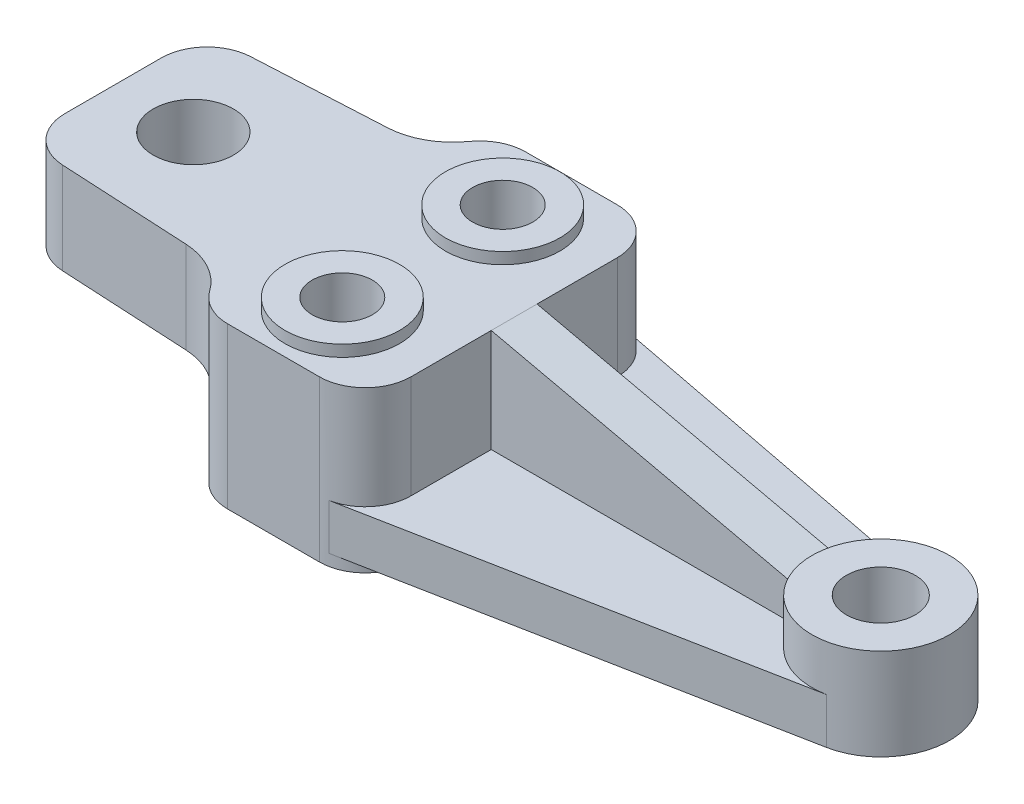
ISO-10303-21;
HEADER;
FILE_DESCRIPTION(('STEP AP214'),'2;1');
FILE_NAME('part.step','',(''),(''),'','','');
FILE_SCHEMA(('AUTOMOTIVE_DESIGN { 1 0 10303 214 1 1 1 1 }'));
ENDSEC;
DATA;
#1=APPLICATION_CONTEXT('core data for automotive mechanical design processes');
#2=APPLICATION_PROTOCOL_DEFINITION('international standard','automotive_design',2000,#1);
#3=PRODUCT_CONTEXT('',#1,'mechanical');
#4=PRODUCT('Part','Part','',(#3));
#5=PRODUCT_RELATED_PRODUCT_CATEGORY('part','',(#4));
#6=PRODUCT_DEFINITION_FORMATION('','',#4);
#7=PRODUCT_DEFINITION_CONTEXT('part definition',#1,'design');
#8=PRODUCT_DEFINITION('design','',#6,#7);
#9=PRODUCT_DEFINITION_SHAPE('','',#8);
#10=(LENGTH_UNIT() NAMED_UNIT(*) SI_UNIT(.MILLI.,.METRE.));
#11=(NAMED_UNIT(*) PLANE_ANGLE_UNIT() SI_UNIT($,.RADIAN.));
#12=(NAMED_UNIT(*) SI_UNIT($,.STERADIAN.) SOLID_ANGLE_UNIT());
#13=UNCERTAINTY_MEASURE_WITH_UNIT(LENGTH_MEASURE(1.E-05),#10,'distance_accuracy_value','');
#14=(GEOMETRIC_REPRESENTATION_CONTEXT(3) GLOBAL_UNCERTAINTY_ASSIGNED_CONTEXT((#13)) GLOBAL_UNIT_ASSIGNED_CONTEXT((#10,
#11,#12)) REPRESENTATION_CONTEXT('',''));
#15=CARTESIAN_POINT('',(0.,0.,0.));
#16=DIRECTION('',(0.,0.,1.));
#17=DIRECTION('',(1.,0.,0.));
#18=AXIS2_PLACEMENT_3D('',#15,#16,#17);
#19=CARTESIAN_POINT('',(0.,12.7,0.));
#20=DIRECTION('',(-1.,0.,0.));
#21=DIRECTION('',(0.,0.,1.));
#22=AXIS2_PLACEMENT_3D('',#19,#20,#21);
#23=PLANE('',#22);
#24=DIRECTION('',(0.,-1.,0.));
#25=VECTOR('',#24,1.);
#26=CARTESIAN_POINT('',(0.,12.7,28.5749999999999));
#27=LINE('',#26,#25);
#28=CARTESIAN_POINT('',(0.,15.875,28.5749999999999));
#29=VERTEX_POINT('',#28);
#30=CARTESIAN_POINT('',(0.,-3.175,28.5749999999999));
#31=VERTEX_POINT('',#30);
#32=EDGE_CURVE('E443',#29,#31,#27,.T.);
#33=ORIENTED_EDGE('',*,*,#32,.F.);
#34=DIRECTION('',(0.,0.,1.));
#35=VECTOR('',#34,1.);
#36=CARTESIAN_POINT('',(0.,15.875,0.));
#37=LINE('',#36,#35);
#38=CARTESIAN_POINT('',(0.,15.875,-28.5749999999999));
#39=VERTEX_POINT('',#38);
#40=EDGE_CURVE('E243',#39,#29,#37,.T.);
#41=ORIENTED_EDGE('',*,*,#40,.F.);
#42=DIRECTION('',(0.,-1.,0.));
#43=VECTOR('',#42,1.);
#44=CARTESIAN_POINT('',(0.,12.7,-28.5749999999999));
#45=LINE('',#44,#43);
#46=CARTESIAN_POINT('',(0.,-3.175,-28.5749999999999));
#47=VERTEX_POINT('',#46);
#48=EDGE_CURVE('E445',#39,#47,#45,.T.);
#49=ORIENTED_EDGE('',*,*,#48,.T.);
#50=DIRECTION('',(0.,0.,-1.));
#51=VECTOR('',#50,1.);
#52=CARTESIAN_POINT('',(0.,-3.175,0.));
#53=LINE('',#52,#51);
#54=EDGE_CURVE('E378',#31,#47,#53,.T.);
#55=ORIENTED_EDGE('',*,*,#54,.F.);
#56=EDGE_LOOP('',(#33,#41,#49,#55));
#57=FACE_BOUND('',#56,.T.);
#58=ADVANCED_FACE('F47',(#57),#23,.T.);
#59=CARTESIAN_POINT('',(0.,41.275,0.));
#60=DIRECTION('',(0.,1.,0.));
#61=DIRECTION('',(0.,0.,1.));
#62=AXIS2_PLACEMENT_3D('',#59,#60,#61);
#63=PLANE('',#62);
#64=CARTESIAN_POINT('',(12.7,41.275,-28.575));
#65=DIRECTION('',(0.,1.,0.));
#66=DIRECTION('',(0.,0.,1.));
#67=AXIS2_PLACEMENT_3D('',#64,#65,#66);
#68=CIRCLE('',#67,12.7);
#69=CARTESIAN_POINT('',(12.7000000000001,41.275,-41.275));
#70=VERTEX_POINT('',#69);
#71=CARTESIAN_POINT('',(2.34506952468571,41.275,-35.9279187980969));
#72=VERTEX_POINT('',#71);
#73=EDGE_CURVE('E355',#70,#72,#68,.T.);
#74=ORIENTED_EDGE('',*,*,#73,.T.);
#75=CARTESIAN_POINT('',(-13.1873261882857,41.275,-46.9572969952424));
#76=DIRECTION('',(0.,1.,0.));
#77=DIRECTION('',(0.,0.,1.));
#78=AXIS2_PLACEMENT_3D('',#75,#76,#77);
#79=CIRCLE('',#78,19.05);
#80=CARTESIAN_POINT('',(-12.1860804172971,41.275,-27.933627346458));
#81=VERTEX_POINT('',#80);
#82=EDGE_CURVE('E262',#81,#72,#79,.T.);
#83=ORIENTED_EDGE('',*,*,#82,.F.);
#84=DIRECTION('',(0.99861782933251,0.,-0.0525588331227634));
#85=VECTOR('',#84,1.);
#86=CARTESIAN_POINT('',(-1.49979281767955,41.275,-28.4960635359116));
#87=LINE('',#86,#85);
#88=CARTESIAN_POINT('',(-48.2924971806591,41.275,-26.0332896220706));
#89=VERTEX_POINT('',#88);
#90=EDGE_CURVE('E235',#89,#81,#87,.T.);
#91=ORIENTED_EDGE('',*,*,#90,.F.);
#92=CARTESIAN_POINT('',(-47.625,41.275,-13.3508431895477));
#93=DIRECTION('',(0.,1.,0.));
#94=DIRECTION('',(0.,0.,1.));
#95=AXIS2_PLACEMENT_3D('',#92,#93,#94);
#96=CIRCLE('',#95,12.7);
#97=CARTESIAN_POINT('',(-60.325,41.275,-13.3508431895477));
#98=VERTEX_POINT('',#97);
#99=EDGE_CURVE('E265',#89,#98,#96,.T.);
#100=ORIENTED_EDGE('',*,*,#99,.T.);
#101=DIRECTION('',(0.,0.,1.));
#102=VECTOR('',#101,1.);
#103=CARTESIAN_POINT('',(-60.325,41.275,0.));
#104=LINE('',#103,#102);
#105=CARTESIAN_POINT('',(-60.325,41.275,13.3508431895477));
#106=VERTEX_POINT('',#105);
#107=EDGE_CURVE('E268',#98,#106,#104,.T.);
#108=ORIENTED_EDGE('',*,*,#107,.T.);
#109=CARTESIAN_POINT('',(-47.625,41.275,13.3508431895477));
#110=DIRECTION('',(0.,1.,0.));
#111=DIRECTION('',(0.,0.,1.));
#112=AXIS2_PLACEMENT_3D('',#109,#110,#111);
#113=CIRCLE('',#112,12.7);
#114=CARTESIAN_POINT('',(-48.2924971806591,41.275,26.0332896220706));
#115=VERTEX_POINT('',#114);
#116=EDGE_CURVE('E271',#106,#115,#113,.T.);
#117=ORIENTED_EDGE('',*,*,#116,.T.);
#118=DIRECTION('',(0.99861782933251,0.,0.0525588331227633));
#119=VECTOR('',#118,1.);
#120=CARTESIAN_POINT('',(-1.49979281767955,41.275,28.4960635359116));
#121=LINE('',#120,#119);
#122=CARTESIAN_POINT('',(-12.1860804172971,41.275,27.9336273464581));
#123=VERTEX_POINT('',#122);
#124=EDGE_CURVE('E274',#115,#123,#121,.T.);
#125=ORIENTED_EDGE('',*,*,#124,.T.);
#126=CARTESIAN_POINT('',(-13.1873261882857,41.275,46.9572969952424));
#127=DIRECTION('',(0.,1.,0.));
#128=DIRECTION('',(0.,0.,1.));
#129=AXIS2_PLACEMENT_3D('',#126,#127,#128);
#130=CIRCLE('',#129,19.05);
#131=CARTESIAN_POINT('',(2.34506952468572,41.275,35.9279187980969));
#132=VERTEX_POINT('',#131);
#133=EDGE_CURVE('E277',#132,#123,#130,.T.);
#134=ORIENTED_EDGE('',*,*,#133,.F.);
#135=CARTESIAN_POINT('',(12.7,41.275,28.575));
#136=DIRECTION('',(0.,1.,0.));
#137=DIRECTION('',(0.,0.,1.));
#138=AXIS2_PLACEMENT_3D('',#135,#136,#137);
#139=CIRCLE('',#138,12.7);
#140=CARTESIAN_POINT('',(12.7000000000001,41.275,41.275));
#141=VERTEX_POINT('',#140);
#142=EDGE_CURVE('E357',#141,#132,#139,.F.);
#143=ORIENTED_EDGE('',*,*,#142,.F.);
#144=DIRECTION('',(-1.,0.,0.));
#145=VECTOR('',#144,1.);
#146=CARTESIAN_POINT('',(0.,41.275,41.275));
#147=LINE('',#146,#145);
#148=CARTESIAN_POINT('',(38.0999999999999,41.275,41.275));
#149=VERTEX_POINT('',#148);
#150=EDGE_CURVE('E359',#149,#141,#147,.T.);
#151=ORIENTED_EDGE('',*,*,#150,.F.);
#152=CARTESIAN_POINT('',(38.1,41.275,28.575));
#153=DIRECTION('',(0.,1.,0.));
#154=DIRECTION('',(0.,0.,1.));
#155=AXIS2_PLACEMENT_3D('',#152,#153,#154);
#156=CIRCLE('',#155,12.7);
#157=CARTESIAN_POINT('',(50.8,41.275,28.5749999999999));
#158=VERTEX_POINT('',#157);
#159=EDGE_CURVE('E362',#149,#158,#156,.T.);
#160=ORIENTED_EDGE('',*,*,#159,.T.);
#161=DIRECTION('',(0.,0.,1.));
#162=VECTOR('',#161,1.);
#163=CARTESIAN_POINT('',(50.8,41.275,0.));
#164=LINE('',#163,#162);
#165=CARTESIAN_POINT('',(50.8,41.275,6.35));
#166=VERTEX_POINT('',#165);
#167=EDGE_CURVE('E365',#166,#158,#164,.T.);
#168=ORIENTED_EDGE('',*,*,#167,.F.);
#169=DIRECTION('',(0.,0.,1.));
#170=VECTOR('',#169,1.);
#171=CARTESIAN_POINT('',(50.8,41.275,0.));
#172=LINE('',#171,#170);
#173=CARTESIAN_POINT('',(50.8,41.275,-6.35));
#174=VERTEX_POINT('',#173);
#175=EDGE_CURVE('E316',#174,#166,#172,.T.);
#176=ORIENTED_EDGE('',*,*,#175,.F.);
#177=CARTESIAN_POINT('',(50.8,41.275,-28.5749999999999));
#178=VERTEX_POINT('',#177);
#179=EDGE_CURVE('E366',#178,#174,#164,.T.);
#180=ORIENTED_EDGE('',*,*,#179,.F.);
#181=CARTESIAN_POINT('',(38.1,41.275,-28.575));
#182=DIRECTION('',(0.,1.,0.));
#183=DIRECTION('',(0.,0.,1.));
#184=AXIS2_PLACEMENT_3D('',#181,#182,#183);
#185=CIRCLE('',#184,12.7);
#186=CARTESIAN_POINT('',(38.0999999999999,41.275,-41.275));
#187=VERTEX_POINT('',#186);
#188=EDGE_CURVE('E349',#187,#178,#185,.F.);
#189=ORIENTED_EDGE('',*,*,#188,.F.);
#190=DIRECTION('',(-1.,0.,0.));
#191=VECTOR('',#190,1.);
#192=CARTESIAN_POINT('',(0.,41.275,-41.275));
#193=LINE('',#192,#191);
#194=EDGE_CURVE('E352',#187,#70,#193,.T.);
#195=ORIENTED_EDGE('',*,*,#194,.T.);
#196=EDGE_LOOP('',(#74,#83,#91,#100,#108,#117,#125,#134,#143,#151,#160,#168,#176,#180,#189,#195));
#197=FACE_BOUND('',#196,.T.);
#198=CARTESIAN_POINT('',(25.4,41.275,22.225));
#199=DIRECTION('',(0.,1.,0.));
#200=DIRECTION('',(0.,0.,1.));
#201=AXIS2_PLACEMENT_3D('',#198,#199,#200);
#202=CIRCLE('',#201,15.875);
#203=CARTESIAN_POINT('',(25.4,41.275,38.1));
#204=VERTEX_POINT('',#203);
#205=EDGE_CURVE('E306',#204,#204,#202,.T.);
#206=ORIENTED_EDGE('',*,*,#205,.F.);
#207=EDGE_LOOP('',(#206));
#208=FACE_BOUND('',#207,.T.);
#209=CARTESIAN_POINT('',(25.4,41.275,-22.225));
#210=DIRECTION('',(0.,1.,0.));
#211=DIRECTION('',(0.,0.,1.));
#212=AXIS2_PLACEMENT_3D('',#209,#210,#211);
#213=CIRCLE('',#212,15.875);
#214=CARTESIAN_POINT('',(25.4,41.275,-6.35));
#215=VERTEX_POINT('',#214);
#216=EDGE_CURVE('E297',#215,#215,#213,.T.);
#217=ORIENTED_EDGE('',*,*,#216,.F.);
#218=EDGE_LOOP('',(#217));
#219=FACE_BOUND('',#218,.T.);
#220=CARTESIAN_POINT('',(-38.1,41.275,0.));
#221=DIRECTION('',(0.,1.,0.));
#222=DIRECTION('',(0.,0.,1.));
#223=AXIS2_PLACEMENT_3D('',#220,#221,#222);
#224=CIRCLE('',#223,11.1125);
#225=CARTESIAN_POINT('',(-38.1,41.275,11.1125));
#226=VERTEX_POINT('',#225);
#227=EDGE_CURVE('E259',#226,#226,#224,.T.);
#228=ORIENTED_EDGE('',*,*,#227,.F.);
#229=EDGE_LOOP('',(#228));
#230=FACE_BOUND('',#229,.T.);
#231=ADVANCED_FACE('F483',(#197,#208,#219,#230),#63,.T.);
#232=CARTESIAN_POINT('',(0.,12.7,0.));
#233=DIRECTION('',(0.,1.,0.));
#234=DIRECTION('',(0.,0.,1.));
#235=AXIS2_PLACEMENT_3D('',#232,#233,#234);
#236=PLANE('',#235);
#237=DIRECTION('',(0.,0.,1.));
#238=VECTOR('',#237,1.);
#239=CARTESIAN_POINT('',(50.8,12.7,0.));
#240=LINE('',#239,#238);
#241=CARTESIAN_POINT('',(50.8,12.7,-28.5749999999999));
#242=VERTEX_POINT('',#241);
#243=CARTESIAN_POINT('',(50.8,12.7,-6.35));
#244=VERTEX_POINT('',#243);
#245=EDGE_CURVE('E410',#242,#244,#240,.T.);
#246=ORIENTED_EDGE('',*,*,#245,.T.);
#247=DIRECTION('',(1.,0.,0.));
#248=VECTOR('',#247,1.);
#249=CARTESIAN_POINT('',(0.,12.7,-6.35));
#250=LINE('',#249,#248);
#251=CARTESIAN_POINT('',(134.439487757862,12.7,-6.35));
#252=VERTEX_POINT('',#251);
#253=EDGE_CURVE('E324',#244,#252,#250,.T.);
#254=ORIENTED_EDGE('',*,*,#253,.T.);
#255=CARTESIAN_POINT('',(152.4,12.7,0.));
#256=DIRECTION('',(0.,1.,0.));
#257=DIRECTION('',(0.,0.,1.));
#258=AXIS2_PLACEMENT_3D('',#255,#256,#257);
#259=CIRCLE('',#258,19.05);
#260=CARTESIAN_POINT('',(156.017509664379,12.7,-18.7033719908503));
#261=VERTEX_POINT('',#260);
#262=EDGE_CURVE('E345',#252,#261,#259,.F.);
#263=ORIENTED_EDGE('',*,*,#262,.T.);
#264=DIRECTION('',(-0.981804303981642,0.,-0.189895520439855));
#265=VECTOR('',#264,1.);
#266=CARTESIAN_POINT('',(9.11310070768723,12.7,-47.116864456312));
#267=LINE('',#266,#265);
#268=CARTESIAN_POINT('',(40.5116731095862,12.7,-41.0439146605669));
#269=VERTEX_POINT('',#268);
#270=EDGE_CURVE('E416',#261,#269,#267,.T.);
#271=ORIENTED_EDGE('',*,*,#270,.T.);
#272=CARTESIAN_POINT('',(38.1,12.7,-28.575));
#273=DIRECTION('',(0.,1.,0.));
#274=DIRECTION('',(0.,0.,1.));
#275=AXIS2_PLACEMENT_3D('',#272,#273,#274);
#276=CIRCLE('',#275,12.7);
#277=EDGE_CURVE('E413',#269,#242,#276,.F.);
#278=ORIENTED_EDGE('',*,*,#277,.T.);
#279=EDGE_LOOP('',(#246,#254,#263,#271,#278));
#280=FACE_BOUND('',#279,.T.);
#281=ADVANCED_FACE('F526',(#280),#236,.T.);
#282=CARTESIAN_POINT('',(50.8,-3.175,0.));
#283=DIRECTION('',(-1.,0.,0.));
#284=DIRECTION('',(0.,0.,1.));
#285=AXIS2_PLACEMENT_3D('',#282,#283,#284);
#286=PLANE('',#285);
#287=DIRECTION('',(0.,1.,0.));
#288=VECTOR('',#287,1.);
#289=CARTESIAN_POINT('',(50.8,-3.175,-6.35));
#290=LINE('',#289,#288);
#291=EDGE_CURVE('E321',#244,#174,#290,.T.);
#292=ORIENTED_EDGE('',*,*,#291,.F.);
#293=ORIENTED_EDGE('',*,*,#245,.F.);
#294=DIRECTION('',(0.,1.,0.));
#295=VECTOR('',#294,1.);
#296=CARTESIAN_POINT('',(50.8,-3.175,-28.5749999999999));
#297=LINE('',#296,#295);
#298=EDGE_CURVE('E403',#242,#178,#297,.T.);
#299=ORIENTED_EDGE('',*,*,#298,.T.);
#300=ORIENTED_EDGE('',*,*,#179,.T.);
#301=EDGE_LOOP('',(#292,#293,#299,#300));
#302=FACE_BOUND('',#301,.T.);
#303=ADVANCED_FACE('F523',(#302),#286,.F.);
#304=DIRECTION('',(1.,0.,0.));
#305=VECTOR('',#304,1.);
#306=CARTESIAN_POINT('',(0.,12.7,6.35));
#307=LINE('',#306,#305);
#308=CARTESIAN_POINT('',(50.8,12.7,6.35));
#309=VERTEX_POINT('',#308);
#310=CARTESIAN_POINT('',(134.439487757862,12.7,6.35));
#311=VERTEX_POINT('',#310);
#312=EDGE_CURVE('E332',#309,#311,#307,.T.);
#313=ORIENTED_EDGE('',*,*,#312,.F.);
#314=CARTESIAN_POINT('',(50.8,12.7,28.5749999999999));
#315=VERTEX_POINT('',#314);
#316=EDGE_CURVE('E409',#309,#315,#240,.T.);
#317=ORIENTED_EDGE('',*,*,#316,.T.);
#318=CARTESIAN_POINT('',(38.1,12.7,28.575));
#319=DIRECTION('',(0.,1.,0.));
#320=DIRECTION('',(0.,0.,1.));
#321=AXIS2_PLACEMENT_3D('',#318,#319,#320);
#322=CIRCLE('',#321,12.7);
#323=CARTESIAN_POINT('',(40.5116731095862,12.7,41.0439146605669));
#324=VERTEX_POINT('',#323);
#325=EDGE_CURVE('E402',#324,#315,#322,.T.);
#326=ORIENTED_EDGE('',*,*,#325,.F.);
#327=DIRECTION('',(-0.981804303981642,0.,0.189895520439855));
#328=VECTOR('',#327,1.);
#329=CARTESIAN_POINT('',(9.11310070768723,12.7,47.116864456312));
#330=LINE('',#329,#328);
#331=CARTESIAN_POINT('',(156.017509664379,12.7,18.7033719908503));
#332=VERTEX_POINT('',#331);
#333=EDGE_CURVE('E418',#332,#324,#330,.T.);
#334=ORIENTED_EDGE('',*,*,#333,.F.);
#335=EDGE_CURVE('E346',#332,#311,#259,.F.);
#336=ORIENTED_EDGE('',*,*,#335,.T.);
#337=EDGE_LOOP('',(#313,#317,#326,#334,#336));
#338=FACE_BOUND('',#337,.T.);
#339=ADVANCED_FACE('F510',(#338),#236,.T.);
#340=CARTESIAN_POINT('',(0.,0.,0.));
#341=DIRECTION('',(0.,1.,0.));
#342=DIRECTION('',(0.,0.,1.));
#343=AXIS2_PLACEMENT_3D('',#340,#341,#342);
#344=PLANE('',#343);
#345=CARTESIAN_POINT('',(152.4,0.,0.));
#346=DIRECTION('',(0.,1.,0.));
#347=DIRECTION('',(0.,0.,1.));
#348=AXIS2_PLACEMENT_3D('',#345,#346,#347);
#349=CIRCLE('',#348,9.525);
#350=CARTESIAN_POINT('',(152.4,0.,9.525));
#351=VERTEX_POINT('',#350);
#352=EDGE_CURVE('E419',#351,#351,#349,.T.);
#353=ORIENTED_EDGE('',*,*,#352,.T.);
#354=EDGE_LOOP('',(#353));
#355=FACE_BOUND('',#354,.T.);
#356=CARTESIAN_POINT('',(38.1,0.,28.575));
#357=DIRECTION('',(0.,1.,0.));
#358=DIRECTION('',(0.,0.,1.));
#359=AXIS2_PLACEMENT_3D('',#356,#357,#358);
#360=CIRCLE('',#359,12.7);
#361=CARTESIAN_POINT('',(40.5116731095862,0.,41.0439146605668));
#362=VERTEX_POINT('',#361);
#363=CARTESIAN_POINT('',(50.8,0.,28.5749999999999));
#364=VERTEX_POINT('',#363);
#365=EDGE_CURVE('E454',#362,#364,#360,.T.);
#366=ORIENTED_EDGE('',*,*,#365,.T.);
#367=DIRECTION('',(0.,0.,1.));
#368=VECTOR('',#367,1.);
#369=CARTESIAN_POINT('',(50.8,0.,0.));
#370=LINE('',#369,#368);
#371=CARTESIAN_POINT('',(50.8,0.,-28.5749999999999));
#372=VERTEX_POINT('',#371);
#373=EDGE_CURVE('E55',#372,#364,#370,.T.);
#374=ORIENTED_EDGE('',*,*,#373,.F.);
#375=CARTESIAN_POINT('',(38.1,0.,-28.575));
#376=DIRECTION('',(0.,1.,0.));
#377=DIRECTION('',(0.,0.,1.));
#378=AXIS2_PLACEMENT_3D('',#375,#376,#377);
#379=CIRCLE('',#378,12.7);
#380=CARTESIAN_POINT('',(40.5116731095862,0.,-41.0439146605669));
#381=VERTEX_POINT('',#380);
#382=EDGE_CURVE('E12',#381,#372,#379,.F.);
#383=ORIENTED_EDGE('',*,*,#382,.F.);
#384=DIRECTION('',(-0.981804303981642,0.,-0.189895520439855));
#385=VECTOR('',#384,1.);
#386=CARTESIAN_POINT('',(9.11310070768723,0.,-47.116864456312));
#387=LINE('',#386,#385);
#388=CARTESIAN_POINT('',(156.017509664379,0.,-18.7033719908503));
#389=VERTEX_POINT('',#388);
#390=EDGE_CURVE('E415',#389,#381,#387,.T.);
#391=ORIENTED_EDGE('',*,*,#390,.F.);
#392=CARTESIAN_POINT('',(152.4,0.,0.));
#393=DIRECTION('',(0.,1.,0.));
#394=DIRECTION('',(0.,0.,1.));
#395=AXIS2_PLACEMENT_3D('',#392,#393,#394);
#396=CIRCLE('',#395,19.05);
#397=CARTESIAN_POINT('',(156.017509664379,0.,18.7033719908503));
#398=VERTEX_POINT('',#397);
#399=EDGE_CURVE('E428',#398,#389,#396,.T.);
#400=ORIENTED_EDGE('',*,*,#399,.F.);
#401=DIRECTION('',(-0.981804303981642,0.,0.189895520439855));
#402=VECTOR('',#401,1.);
#403=CARTESIAN_POINT('',(9.11310070768723,0.,47.116864456312));
#404=LINE('',#403,#402);
#405=EDGE_CURVE('E425',#398,#362,#404,.T.);
#406=ORIENTED_EDGE('',*,*,#405,.T.);
#407=EDGE_LOOP('',(#366,#374,#383,#391,#400,#406));
#408=FACE_BOUND('',#407,.T.);
#409=ADVANCED_FACE('F466',(#355,#408),#344,.F.);
#410=CARTESIAN_POINT('',(9.11310070768723,12.7,-47.116864456312));
#411=DIRECTION('',(-0.189895520439855,0.,0.981804303981642));
#412=DIRECTION('',(0.981804303981642,0.,0.189895520439855));
#413=AXIS2_PLACEMENT_3D('',#410,#411,#412);
#414=PLANE('',#413);
#415=ORIENTED_EDGE('',*,*,#390,.T.);
#416=DIRECTION('',(0.,-1.,0.));
#417=VECTOR('',#416,1.);
#418=CARTESIAN_POINT('',(40.5116731095862,12.7,-41.0439146605669));
#419=LINE('',#418,#417);
#420=EDGE_CURVE('E451',#269,#381,#419,.T.);
#421=ORIENTED_EDGE('',*,*,#420,.F.);
#422=ORIENTED_EDGE('',*,*,#270,.F.);
#423=DIRECTION('',(0.,-1.,0.));
#424=VECTOR('',#423,1.);
#425=CARTESIAN_POINT('',(156.017509664379,12.7,-18.7033719908503));
#426=LINE('',#425,#424);
#427=EDGE_CURVE('E422',#261,#389,#426,.T.);
#428=ORIENTED_EDGE('',*,*,#427,.T.);
#429=EDGE_LOOP('',(#415,#421,#422,#428));
#430=FACE_BOUND('',#429,.T.);
#431=ADVANCED_FACE('F49',(#430),#414,.F.);
#432=CARTESIAN_POINT('',(38.1,12.7,-28.575));
#433=DIRECTION('',(0.,-1.,0.));
#434=DIRECTION('',(0.,0.,-1.));
#435=AXIS2_PLACEMENT_3D('',#432,#433,#434);
#436=CYLINDRICAL_SURFACE('',#435,12.7);
#437=ORIENTED_EDGE('',*,*,#420,.T.);
#438=ORIENTED_EDGE('',*,*,#382,.T.);
#439=CARTESIAN_POINT('',(50.8,-3.175,-28.5749999999999));
#440=VERTEX_POINT('',#439);
#441=EDGE_CURVE('E399',#440,#372,#297,.T.);
#442=ORIENTED_EDGE('',*,*,#441,.F.);
#443=CARTESIAN_POINT('',(38.1,-3.175,-28.575));
#444=DIRECTION('',(0.,1.,0.));
#445=DIRECTION('',(0.,0.,1.));
#446=AXIS2_PLACEMENT_3D('',#443,#444,#445);
#447=CIRCLE('',#446,12.7);
#448=CARTESIAN_POINT('',(38.0999999999999,-3.175,-41.275));
#449=VERTEX_POINT('',#448);
#450=EDGE_CURVE('E369',#449,#440,#447,.F.);
#451=ORIENTED_EDGE('',*,*,#450,.F.);
#452=DIRECTION('',(0.,-1.,0.));
#453=VECTOR('',#452,1.);
#454=CARTESIAN_POINT('',(38.0999999999999,12.7,-41.275));
#455=LINE('',#454,#453);
#456=EDGE_CURVE('E449',#187,#449,#455,.T.);
#457=ORIENTED_EDGE('',*,*,#456,.F.);
#458=ORIENTED_EDGE('',*,*,#188,.T.);
#459=ORIENTED_EDGE('',*,*,#298,.F.);
#460=ORIENTED_EDGE('',*,*,#277,.F.);
#461=EDGE_LOOP('',(#437,#438,#442,#451,#457,#458,#459,#460));
#462=FACE_BOUND('',#461,.T.);
#463=ADVANCED_FACE('F499',(#462),#436,.T.);
#464=CARTESIAN_POINT('',(0.,12.7,-41.275));
#465=DIRECTION('',(0.,0.,1.));
#466=DIRECTION('',(1.,0.,0.));
#467=AXIS2_PLACEMENT_3D('',#464,#465,#466);
#468=PLANE('',#467);
#469=ORIENTED_EDGE('',*,*,#456,.T.);
#470=DIRECTION('',(-1.,0.,0.));
#471=VECTOR('',#470,1.);
#472=CARTESIAN_POINT('',(0.,-3.175,-41.275));
#473=LINE('',#472,#471);
#474=CARTESIAN_POINT('',(12.7000000000001,-3.175,-41.275));
#475=VERTEX_POINT('',#474);
#476=EDGE_CURVE('E372',#449,#475,#473,.T.);
#477=ORIENTED_EDGE('',*,*,#476,.T.);
#478=DIRECTION('',(0.,-1.,0.));
#479=VECTOR('',#478,1.);
#480=CARTESIAN_POINT('',(12.7000000000001,12.7,-41.275));
#481=LINE('',#480,#479);
#482=EDGE_CURVE('E447',#70,#475,#481,.T.);
#483=ORIENTED_EDGE('',*,*,#482,.F.);
#484=ORIENTED_EDGE('',*,*,#194,.F.);
#485=EDGE_LOOP('',(#469,#477,#483,#484));
#486=FACE_BOUND('',#485,.T.);
#487=ADVANCED_FACE('F532',(#486),#468,.F.);
#488=CARTESIAN_POINT('',(12.7,12.7,-28.575));
#489=DIRECTION('',(0.,-1.,0.));
#490=DIRECTION('',(0.,0.,-1.));
#491=AXIS2_PLACEMENT_3D('',#488,#489,#490);
#492=CYLINDRICAL_SURFACE('',#491,12.7);
#493=CARTESIAN_POINT('',(12.7,15.875,-28.575));
#494=DIRECTION('',(0.,1.,0.));
#495=DIRECTION('',(0.,0.,1.));
#496=AXIS2_PLACEMENT_3D('',#493,#494,#495);
#497=CIRCLE('',#496,12.7);
#498=CARTESIAN_POINT('',(2.3450695246857,15.875,-35.927918798097));
#499=VERTEX_POINT('',#498);
#500=EDGE_CURVE('E62',#499,#39,#497,.T.);
#501=ORIENTED_EDGE('',*,*,#500,.F.);
#502=DIRECTION('',(0.,1.,0.));
#503=VECTOR('',#502,1.);
#504=CARTESIAN_POINT('',(2.34506952468571,15.875,-35.9279187980969));
#505=LINE('',#504,#503);
#506=EDGE_CURVE('E67',#499,#72,#505,.T.);
#507=ORIENTED_EDGE('',*,*,#506,.T.);
#508=ORIENTED_EDGE('',*,*,#73,.F.);
#509=ORIENTED_EDGE('',*,*,#482,.T.);
#510=CARTESIAN_POINT('',(12.7,-3.175,-28.575));
#511=DIRECTION('',(0.,1.,0.));
#512=DIRECTION('',(0.,0.,1.));
#513=AXIS2_PLACEMENT_3D('',#510,#511,#512);
#514=CIRCLE('',#513,12.7);
#515=EDGE_CURVE('E375',#475,#47,#514,.T.);
#516=ORIENTED_EDGE('',*,*,#515,.T.);
#517=ORIENTED_EDGE('',*,*,#48,.F.);
#518=EDGE_LOOP('',(#501,#507,#508,#509,#516,#517));
#519=FACE_BOUND('',#518,.T.);
#520=ADVANCED_FACE('F530',(#519),#492,.T.);
#521=CARTESIAN_POINT('',(12.7,12.7,28.575));
#522=DIRECTION('',(0.,-1.,0.));
#523=DIRECTION('',(0.,0.,-1.));
#524=AXIS2_PLACEMENT_3D('',#521,#522,#523);
#525=CYLINDRICAL_SURFACE('',#524,12.7);
#526=DIRECTION('',(0.,1.,0.));
#527=VECTOR('',#526,1.);
#528=CARTESIAN_POINT('',(2.34506952468572,15.875,35.9279187980969));
#529=LINE('',#528,#527);
#530=CARTESIAN_POINT('',(2.34506952468572,15.875,35.9279187980969));
#531=VERTEX_POINT('',#530);
#532=EDGE_CURVE('E281',#531,#132,#529,.T.);
#533=ORIENTED_EDGE('',*,*,#532,.F.);
#534=CARTESIAN_POINT('',(12.7,15.875,28.575));
#535=DIRECTION('',(0.,1.,0.));
#536=DIRECTION('',(0.,0.,1.));
#537=AXIS2_PLACEMENT_3D('',#534,#535,#536);
#538=CIRCLE('',#537,12.7);
#539=EDGE_CURVE('E642',#29,#531,#538,.T.);
#540=ORIENTED_EDGE('',*,*,#539,.F.);
#541=ORIENTED_EDGE('',*,*,#32,.T.);
#542=CARTESIAN_POINT('',(12.7,-3.175,28.575));
#543=DIRECTION('',(0.,1.,0.));
#544=DIRECTION('',(0.,0.,1.));
#545=AXIS2_PLACEMENT_3D('',#542,#543,#544);
#546=CIRCLE('',#545,12.7);
#547=CARTESIAN_POINT('',(12.7000000000001,-3.175,41.275));
#548=VERTEX_POINT('',#547);
#549=EDGE_CURVE('E381',#548,#31,#546,.F.);
#550=ORIENTED_EDGE('',*,*,#549,.F.);
#551=DIRECTION('',(0.,-1.,0.));
#552=VECTOR('',#551,1.);
#553=CARTESIAN_POINT('',(12.7000000000001,12.7,41.275));
#554=LINE('',#553,#552);
#555=EDGE_CURVE('E441',#141,#548,#554,.T.);
#556=ORIENTED_EDGE('',*,*,#555,.F.);
#557=ORIENTED_EDGE('',*,*,#142,.T.);
#558=EDGE_LOOP('',(#533,#540,#541,#550,#556,#557));
#559=FACE_BOUND('',#558,.T.);
#560=ADVANCED_FACE('F539',(#559),#525,.T.);
#561=CARTESIAN_POINT('',(0.,12.7,41.275));
#562=DIRECTION('',(0.,0.,1.));
#563=DIRECTION('',(1.,0.,0.));
#564=AXIS2_PLACEMENT_3D('',#561,#562,#563);
#565=PLANE('',#564);
#566=ORIENTED_EDGE('',*,*,#555,.T.);
#567=DIRECTION('',(-1.,0.,0.));
#568=VECTOR('',#567,1.);
#569=CARTESIAN_POINT('',(0.,-3.175,41.275));
#570=LINE('',#569,#568);
#571=CARTESIAN_POINT('',(38.0999999999999,-3.175,41.275));
#572=VERTEX_POINT('',#571);
#573=EDGE_CURVE('E384',#572,#548,#570,.T.);
#574=ORIENTED_EDGE('',*,*,#573,.F.);
#575=DIRECTION('',(0.,-1.,0.));
#576=VECTOR('',#575,1.);
#577=CARTESIAN_POINT('',(38.0999999999999,12.7,41.275));
#578=LINE('',#577,#576);
#579=EDGE_CURVE('E439',#149,#572,#578,.T.);
#580=ORIENTED_EDGE('',*,*,#579,.F.);
#581=ORIENTED_EDGE('',*,*,#150,.T.);
#582=EDGE_LOOP('',(#566,#574,#580,#581));
#583=FACE_BOUND('',#582,.T.);
#584=ADVANCED_FACE('F490',(#583),#565,.T.);
#585=CARTESIAN_POINT('',(38.1,12.7,28.575));
#586=DIRECTION('',(0.,-1.,0.));
#587=DIRECTION('',(0.,0.,-1.));
#588=AXIS2_PLACEMENT_3D('',#585,#586,#587);
#589=CYLINDRICAL_SURFACE('',#588,12.7);
#590=ORIENTED_EDGE('',*,*,#579,.T.);
#591=CARTESIAN_POINT('',(38.1,-3.175,28.575));
#592=DIRECTION('',(0.,1.,0.));
#593=DIRECTION('',(0.,0.,1.));
#594=AXIS2_PLACEMENT_3D('',#591,#592,#593);
#595=CIRCLE('',#594,12.7);
#596=CARTESIAN_POINT('',(50.8,-3.175,28.5749999999999));
#597=VERTEX_POINT('',#596);
#598=EDGE_CURVE('E387',#572,#597,#595,.T.);
#599=ORIENTED_EDGE('',*,*,#598,.T.);
#600=DIRECTION('',(0.,1.,0.));
#601=VECTOR('',#600,1.);
#602=CARTESIAN_POINT('',(50.8,-3.175,28.5749999999999));
#603=LINE('',#602,#601);
#604=EDGE_CURVE('E404',#597,#364,#603,.T.);
#605=ORIENTED_EDGE('',*,*,#604,.T.);
#606=ORIENTED_EDGE('',*,*,#365,.F.);
#607=DIRECTION('',(0.,-1.,0.));
#608=VECTOR('',#607,1.);
#609=CARTESIAN_POINT('',(40.5116731095862,12.7,41.0439146605669));
#610=LINE('',#609,#608);
#611=EDGE_CURVE('E436',#324,#362,#610,.T.);
#612=ORIENTED_EDGE('',*,*,#611,.F.);
#613=ORIENTED_EDGE('',*,*,#325,.T.);
#614=EDGE_CURVE('E398',#315,#158,#603,.T.);
#615=ORIENTED_EDGE('',*,*,#614,.T.);
#616=ORIENTED_EDGE('',*,*,#159,.F.);
#617=EDGE_LOOP('',(#590,#599,#605,#606,#612,#613,#615,#616));
#618=FACE_BOUND('',#617,.T.);
#619=ADVANCED_FACE('F463',(#618),#589,.T.);
#620=CARTESIAN_POINT('',(9.11310070768723,12.7,47.116864456312));
#621=DIRECTION('',(0.189895520439855,0.,0.981804303981642));
#622=DIRECTION('',(0.981804303981642,0.,-0.189895520439855));
#623=AXIS2_PLACEMENT_3D('',#620,#621,#622);
#624=PLANE('',#623);
#625=ORIENTED_EDGE('',*,*,#405,.F.);
#626=DIRECTION('',(0.,-1.,0.));
#627=VECTOR('',#626,1.);
#628=CARTESIAN_POINT('',(156.017509664379,12.7,18.7033719908503));
#629=LINE('',#628,#627);
#630=EDGE_CURVE('E434',#332,#398,#629,.T.);
#631=ORIENTED_EDGE('',*,*,#630,.F.);
#632=ORIENTED_EDGE('',*,*,#333,.T.);
#633=ORIENTED_EDGE('',*,*,#611,.T.);
#634=EDGE_LOOP('',(#625,#631,#632,#633));
#635=FACE_BOUND('',#634,.T.);
#636=ADVANCED_FACE('F472',(#635),#624,.T.);
#637=CARTESIAN_POINT('',(152.4,12.7,0.));
#638=DIRECTION('',(0.,-1.,0.));
#639=DIRECTION('',(0.,0.,-1.));
#640=AXIS2_PLACEMENT_3D('',#637,#638,#639);
#641=CYLINDRICAL_SURFACE('',#640,9.525);
#642=ORIENTED_EDGE('',*,*,#352,.F.);
#643=EDGE_LOOP('',(#642));
#644=FACE_BOUND('',#643,.T.);
#645=CARTESIAN_POINT('',(152.4,25.4,0.));
#646=DIRECTION('',(0.,1.,0.));
#647=DIRECTION('',(0.,0.,1.));
#648=AXIS2_PLACEMENT_3D('',#645,#646,#647);
#649=CIRCLE('',#648,9.525);
#650=CARTESIAN_POINT('',(152.4,25.4,9.525));
#651=VERTEX_POINT('',#650);
#652=EDGE_CURVE('E339',#651,#651,#649,.T.);
#653=ORIENTED_EDGE('',*,*,#652,.T.);
#654=EDGE_LOOP('',(#653));
#655=FACE_BOUND('',#654,.T.);
#656=ADVANCED_FACE('F559',(#644,#655),#641,.F.);
#657=CARTESIAN_POINT('',(152.4,12.7,0.));
#658=DIRECTION('',(0.,-1.,0.));
#659=DIRECTION('',(0.,0.,-1.));
#660=AXIS2_PLACEMENT_3D('',#657,#658,#659);
#661=CYLINDRICAL_SURFACE('',#660,19.05);
#662=CARTESIAN_POINT('',(152.4,18.2996995527401,0.));
#663=DIRECTION('',(-0.220565628640378,-0.975372135885824,0.));
#664=DIRECTION('',(0.975372135885824,-0.220565628640378,0.));
#665=AXIS2_PLACEMENT_3D('',#662,#663,#664);
#666=ELLIPSE('',#665,19.5310069860659,19.05);
#667=CARTESIAN_POINT('',(134.439487757862,22.361197239254,-6.35));
#668=VERTEX_POINT('',#667);
#669=CARTESIAN_POINT('',(134.439487757862,22.361197239254,6.35));
#670=VERTEX_POINT('',#669);
#671=EDGE_CURVE('E337',#668,#670,#666,.F.);
#672=ORIENTED_EDGE('',*,*,#671,.T.);
#673=DIRECTION('',(0.,-1.,0.));
#674=VECTOR('',#673,1.);
#675=CARTESIAN_POINT('',(134.439487757862,12.7,6.35));
#676=LINE('',#675,#674);
#677=EDGE_CURVE('E335',#670,#311,#676,.T.);
#678=ORIENTED_EDGE('',*,*,#677,.T.);
#679=ORIENTED_EDGE('',*,*,#335,.F.);
#680=ORIENTED_EDGE('',*,*,#630,.T.);
#681=ORIENTED_EDGE('',*,*,#399,.T.);
#682=ORIENTED_EDGE('',*,*,#427,.F.);
#683=ORIENTED_EDGE('',*,*,#262,.F.);
#684=DIRECTION('',(0.,-1.,0.));
#685=VECTOR('',#684,1.);
#686=CARTESIAN_POINT('',(134.439487757862,12.7,-6.35));
#687=LINE('',#686,#685);
#688=EDGE_CURVE('E326',#668,#252,#687,.T.);
#689=ORIENTED_EDGE('',*,*,#688,.F.);
#690=EDGE_LOOP('',(#672,#678,#679,#680,#681,#682,#683,#689));
#691=FACE_BOUND('',#690,.T.);
#692=CARTESIAN_POINT('',(152.4,25.4,0.));
#693=DIRECTION('',(0.,1.,0.));
#694=DIRECTION('',(0.,0.,1.));
#695=AXIS2_PLACEMENT_3D('',#692,#693,#694);
#696=CIRCLE('',#695,19.05);
#697=CARTESIAN_POINT('',(152.4,25.4,19.05));
#698=VERTEX_POINT('',#697);
#699=EDGE_CURVE('E342',#698,#698,#696,.T.);
#700=ORIENTED_EDGE('',*,*,#699,.F.);
#701=EDGE_LOOP('',(#700));
#702=FACE_BOUND('',#701,.T.);
#703=ADVANCED_FACE('F507',(#691,#702),#661,.T.);
#704=ORIENTED_EDGE('',*,*,#604,.F.);
#705=DIRECTION('',(0.,0.,1.));
#706=VECTOR('',#705,1.);
#707=CARTESIAN_POINT('',(50.8,-3.175,0.));
#708=LINE('',#707,#706);
#709=EDGE_CURVE('E390',#440,#597,#708,.T.);
#710=ORIENTED_EDGE('',*,*,#709,.F.);
#711=ORIENTED_EDGE('',*,*,#441,.T.);
#712=ORIENTED_EDGE('',*,*,#373,.T.);
#713=EDGE_LOOP('',(#704,#710,#711,#712));
#714=FACE_BOUND('',#713,.T.);
#715=ADVANCED_FACE('F459',(#714),#286,.F.);
#716=CARTESIAN_POINT('',(0.,-3.175,0.));
#717=DIRECTION('',(0.,1.,0.));
#718=DIRECTION('',(0.,0.,1.));
#719=AXIS2_PLACEMENT_3D('',#716,#717,#718);
#720=PLANE('',#719);
#721=ORIENTED_EDGE('',*,*,#54,.T.);
#722=ORIENTED_EDGE('',*,*,#515,.F.);
#723=ORIENTED_EDGE('',*,*,#476,.F.);
#724=ORIENTED_EDGE('',*,*,#450,.T.);
#725=ORIENTED_EDGE('',*,*,#709,.T.);
#726=ORIENTED_EDGE('',*,*,#598,.F.);
#727=ORIENTED_EDGE('',*,*,#573,.T.);
#728=ORIENTED_EDGE('',*,*,#549,.T.);
#729=EDGE_LOOP('',(#721,#722,#723,#724,#725,#726,#727,#728));
#730=FACE_BOUND('',#729,.T.);
#731=CARTESIAN_POINT('',(25.4,-3.175,22.225));
#732=DIRECTION('',(0.,1.,0.));
#733=DIRECTION('',(0.,0.,1.));
#734=AXIS2_PLACEMENT_3D('',#731,#732,#733);
#735=CIRCLE('',#734,8.33437499999999);
#736=CARTESIAN_POINT('',(25.4,-3.175,30.559375));
#737=VERTEX_POINT('',#736);
#738=EDGE_CURVE('E395',#737,#737,#735,.T.);
#739=ORIENTED_EDGE('',*,*,#738,.T.);
#740=EDGE_LOOP('',(#739));
#741=FACE_BOUND('',#740,.T.);
#742=CARTESIAN_POINT('',(25.4,-3.175,-22.225));
#743=DIRECTION('',(0.,1.,0.));
#744=DIRECTION('',(0.,0.,1.));
#745=AXIS2_PLACEMENT_3D('',#742,#743,#744);
#746=CIRCLE('',#745,8.33437499999999);
#747=CARTESIAN_POINT('',(25.4,-3.175,-13.890625));
#748=VERTEX_POINT('',#747);
#749=EDGE_CURVE('E392',#748,#748,#746,.F.);
#750=ORIENTED_EDGE('',*,*,#749,.F.);
#751=EDGE_LOOP('',(#750));
#752=FACE_BOUND('',#751,.T.);
#753=ADVANCED_FACE('F493',(#730,#741,#752),#720,.F.);
#754=CARTESIAN_POINT('',(25.4,12.7,22.225));
#755=DIRECTION('',(0.,-1.,0.));
#756=DIRECTION('',(0.,0.,-1.));
#757=AXIS2_PLACEMENT_3D('',#754,#755,#756);
#758=CYLINDRICAL_SURFACE('',#757,8.33437499999999);
#759=ORIENTED_EDGE('',*,*,#738,.F.);
#760=EDGE_LOOP('',(#759));
#761=FACE_BOUND('',#760,.T.);
#762=CARTESIAN_POINT('',(25.4,44.45,22.225));
#763=DIRECTION('',(0.,1.,0.));
#764=DIRECTION('',(0.,0.,1.));
#765=AXIS2_PLACEMENT_3D('',#762,#763,#764);
#766=CIRCLE('',#765,8.33437499999999);
#767=CARTESIAN_POINT('',(25.4,44.45,30.559375));
#768=VERTEX_POINT('',#767);
#769=EDGE_CURVE('E301',#768,#768,#766,.T.);
#770=ORIENTED_EDGE('',*,*,#769,.T.);
#771=EDGE_LOOP('',(#770));
#772=FACE_BOUND('',#771,.T.);
#773=ADVANCED_FACE('F568',(#761,#772),#758,.F.);
#774=CARTESIAN_POINT('',(25.4,12.7,-22.225));
#775=DIRECTION('',(0.,-1.,0.));
#776=DIRECTION('',(0.,0.,-1.));
#777=AXIS2_PLACEMENT_3D('',#774,#775,#776);
#778=CYLINDRICAL_SURFACE('',#777,8.33437499999999);
#779=ORIENTED_EDGE('',*,*,#749,.T.);
#780=EDGE_LOOP('',(#779));
#781=FACE_BOUND('',#780,.T.);
#782=CARTESIAN_POINT('',(25.4,44.45,-22.225));
#783=DIRECTION('',(0.,1.,0.));
#784=DIRECTION('',(0.,0.,1.));
#785=AXIS2_PLACEMENT_3D('',#782,#783,#784);
#786=CIRCLE('',#785,8.33437499999999);
#787=CARTESIAN_POINT('',(25.4,44.45,-13.890625));
#788=VERTEX_POINT('',#787);
#789=EDGE_CURVE('E284',#788,#788,#786,.T.);
#790=ORIENTED_EDGE('',*,*,#789,.T.);
#791=EDGE_LOOP('',(#790));
#792=FACE_BOUND('',#791,.T.);
#793=ADVANCED_FACE('F565',(#781,#792),#778,.F.);
#794=ORIENTED_EDGE('',*,*,#316,.F.);
#795=DIRECTION('',(0.,1.,0.));
#796=VECTOR('',#795,1.);
#797=CARTESIAN_POINT('',(50.8,-3.175,6.35));
#798=LINE('',#797,#796);
#799=EDGE_CURVE('E329',#309,#166,#798,.T.);
#800=ORIENTED_EDGE('',*,*,#799,.T.);
#801=ORIENTED_EDGE('',*,*,#167,.T.);
#802=ORIENTED_EDGE('',*,*,#614,.F.);
#803=EDGE_LOOP('',(#794,#800,#801,#802));
#804=FACE_BOUND('',#803,.T.);
#805=ADVANCED_FACE('F480',(#804),#286,.F.);
#806=CARTESIAN_POINT('',(0.,25.4,0.));
#807=DIRECTION('',(0.,1.,0.));
#808=DIRECTION('',(0.,0.,1.));
#809=AXIS2_PLACEMENT_3D('',#806,#807,#808);
#810=PLANE('',#809);
#811=ORIENTED_EDGE('',*,*,#652,.F.);
#812=EDGE_LOOP('',(#811));
#813=FACE_BOUND('',#812,.T.);
#814=ORIENTED_EDGE('',*,*,#699,.T.);
#815=EDGE_LOOP('',(#814));
#816=FACE_BOUND('',#815,.T.);
#817=ADVANCED_FACE('F580',(#813,#816),#810,.T.);
#818=CARTESIAN_POINT('',(50.8,41.275,0.));
#819=DIRECTION('',(-0.220565628640378,-0.975372135885824,0.));
#820=DIRECTION('',(0.975372135885824,-0.220565628640378,0.));
#821=AXIS2_PLACEMENT_3D('',#818,#819,#820);
#822=PLANE('',#821);
#823=ORIENTED_EDGE('',*,*,#671,.F.);
#824=DIRECTION('',(0.975372135885824,-0.220565628640378,0.));
#825=VECTOR('',#824,1.);
#826=CARTESIAN_POINT('',(50.8,41.275,-6.35));
#827=LINE('',#826,#825);
#828=EDGE_CURVE('E310',#174,#668,#827,.T.);
#829=ORIENTED_EDGE('',*,*,#828,.F.);
#830=ORIENTED_EDGE('',*,*,#175,.T.);
#831=DIRECTION('',(0.975372135885824,-0.220565628640378,0.));
#832=VECTOR('',#831,1.);
#833=CARTESIAN_POINT('',(50.8,41.275,6.35));
#834=LINE('',#833,#832);
#835=EDGE_CURVE('E313',#166,#670,#834,.T.);
#836=ORIENTED_EDGE('',*,*,#835,.T.);
#837=EDGE_LOOP('',(#823,#829,#830,#836));
#838=FACE_BOUND('',#837,.T.);
#839=ADVANCED_FACE('F516',(#838),#822,.F.);
#840=CARTESIAN_POINT('',(85.725,19.05,6.35));
#841=DIRECTION('',(0.,0.,1.));
#842=DIRECTION('',(1.,0.,0.));
#843=AXIS2_PLACEMENT_3D('',#840,#841,#842);
#844=PLANE('',#843);
#845=ORIENTED_EDGE('',*,*,#677,.F.);
#846=ORIENTED_EDGE('',*,*,#835,.F.);
#847=ORIENTED_EDGE('',*,*,#799,.F.);
#848=ORIENTED_EDGE('',*,*,#312,.T.);
#849=EDGE_LOOP('',(#845,#846,#847,#848));
#850=FACE_BOUND('',#849,.T.);
#851=ADVANCED_FACE('F512',(#850),#844,.T.);
#852=CARTESIAN_POINT('',(85.725,19.05,-6.35));
#853=DIRECTION('',(0.,0.,1.));
#854=DIRECTION('',(1.,0.,0.));
#855=AXIS2_PLACEMENT_3D('',#852,#853,#854);
#856=PLANE('',#855);
#857=ORIENTED_EDGE('',*,*,#828,.T.);
#858=ORIENTED_EDGE('',*,*,#688,.T.);
#859=ORIENTED_EDGE('',*,*,#253,.F.);
#860=ORIENTED_EDGE('',*,*,#291,.T.);
#861=EDGE_LOOP('',(#857,#858,#859,#860));
#862=FACE_BOUND('',#861,.T.);
#863=ADVANCED_FACE('F519',(#862),#856,.F.);
#864=CARTESIAN_POINT('',(25.4,44.45,22.225));
#865=DIRECTION('',(0.,1.,0.));
#866=DIRECTION('',(0.,0.,1.));
#867=AXIS2_PLACEMENT_3D('',#864,#865,#866);
#868=PLANE('',#867);
#869=CARTESIAN_POINT('',(25.4,44.45,22.225));
#870=DIRECTION('',(0.,1.,0.));
#871=DIRECTION('',(0.,0.,1.));
#872=AXIS2_PLACEMENT_3D('',#869,#870,#871);
#873=CIRCLE('',#872,15.875);
#874=CARTESIAN_POINT('',(25.4,44.45,38.1));
#875=VERTEX_POINT('',#874);
#876=EDGE_CURVE('E307',#875,#875,#873,.T.);
#877=ORIENTED_EDGE('',*,*,#876,.T.);
#878=EDGE_LOOP('',(#877));
#879=FACE_BOUND('',#878,.T.);
#880=ORIENTED_EDGE('',*,*,#769,.F.);
#881=EDGE_LOOP('',(#880));
#882=FACE_BOUND('',#881,.T.);
#883=ADVANCED_FACE('F590',(#879,#882),#868,.T.);
#884=CARTESIAN_POINT('',(25.4,44.45,22.225));
#885=DIRECTION('',(0.,-1.,0.));
#886=DIRECTION('',(0.,0.,-1.));
#887=AXIS2_PLACEMENT_3D('',#884,#885,#886);
#888=CYLINDRICAL_SURFACE('',#887,15.875);
#889=ORIENTED_EDGE('',*,*,#876,.F.);
#890=EDGE_LOOP('',(#889));
#891=FACE_BOUND('',#890,.T.);
#892=ORIENTED_EDGE('',*,*,#205,.T.);
#893=EDGE_LOOP('',(#892));
#894=FACE_BOUND('',#893,.T.);
#895=ADVANCED_FACE('F593',(#891,#894),#888,.T.);
#896=CARTESIAN_POINT('',(25.4,44.45,-22.225));
#897=DIRECTION('',(0.,1.,0.));
#898=DIRECTION('',(0.,0.,1.));
#899=AXIS2_PLACEMENT_3D('',#896,#897,#898);
#900=PLANE('',#899);
#901=CARTESIAN_POINT('',(25.4,44.45,-22.225));
#902=DIRECTION('',(0.,1.,0.));
#903=DIRECTION('',(0.,0.,1.));
#904=AXIS2_PLACEMENT_3D('',#901,#902,#903);
#905=CIRCLE('',#904,15.875);
#906=CARTESIAN_POINT('',(25.4,44.45,-6.35));
#907=VERTEX_POINT('',#906);
#908=EDGE_CURVE('E298',#907,#907,#905,.T.);
#909=ORIENTED_EDGE('',*,*,#908,.T.);
#910=EDGE_LOOP('',(#909));
#911=FACE_BOUND('',#910,.T.);
#912=ORIENTED_EDGE('',*,*,#789,.F.);
#913=EDGE_LOOP('',(#912));
#914=FACE_BOUND('',#913,.T.);
#915=ADVANCED_FACE('F596',(#911,#914),#900,.T.);
#916=CARTESIAN_POINT('',(25.4,44.45,-22.225));
#917=DIRECTION('',(0.,-1.,0.));
#918=DIRECTION('',(0.,0.,-1.));
#919=AXIS2_PLACEMENT_3D('',#916,#917,#918);
#920=CYLINDRICAL_SURFACE('',#919,15.875);
#921=ORIENTED_EDGE('',*,*,#908,.F.);
#922=EDGE_LOOP('',(#921));
#923=FACE_BOUND('',#922,.T.);
#924=ORIENTED_EDGE('',*,*,#216,.T.);
#925=EDGE_LOOP('',(#924));
#926=FACE_BOUND('',#925,.T.);
#927=ADVANCED_FACE('F601',(#923,#926),#920,.T.);
#928=CARTESIAN_POINT('',(-13.1873261882857,15.875,46.9572969952424));
#929=DIRECTION('',(0.,1.,0.));
#930=DIRECTION('',(0.,0.,1.));
#931=AXIS2_PLACEMENT_3D('',#928,#929,#930);
#932=CYLINDRICAL_SURFACE('',#931,19.05);
#933=ORIENTED_EDGE('',*,*,#133,.T.);
#934=DIRECTION('',(0.,1.,0.));
#935=VECTOR('',#934,1.);
#936=CARTESIAN_POINT('',(-12.1860804172971,15.875,27.9336273464581));
#937=LINE('',#936,#935);
#938=CARTESIAN_POINT('',(-12.1860804172971,15.875,27.9336273464581));
#939=VERTEX_POINT('',#938);
#940=EDGE_CURVE('E285',#939,#123,#937,.T.);
#941=ORIENTED_EDGE('',*,*,#940,.F.);
#942=CARTESIAN_POINT('',(-13.1873261882857,15.875,46.9572969952424));
#943=DIRECTION('',(0.,1.,0.));
#944=DIRECTION('',(0.,0.,1.));
#945=AXIS2_PLACEMENT_3D('',#942,#943,#944);
#946=CIRCLE('',#945,19.05);
#947=EDGE_CURVE('E257',#531,#939,#946,.T.);
#948=ORIENTED_EDGE('',*,*,#947,.F.);
#949=ORIENTED_EDGE('',*,*,#532,.T.);
#950=EDGE_LOOP('',(#933,#941,#948,#949));
#951=FACE_BOUND('',#950,.T.);
#952=ADVANCED_FACE('F604',(#951),#932,.F.);
#953=CARTESIAN_POINT('',(-1.49979281767955,15.875,28.4960635359116));
#954=DIRECTION('',(-0.0525588331227633,0.,0.99861782933251));
#955=DIRECTION('',(0.99861782933251,0.,0.0525588331227633));
#956=AXIS2_PLACEMENT_3D('',#953,#954,#955);
#957=PLANE('',#956);
#958=ORIENTED_EDGE('',*,*,#124,.F.);
#959=DIRECTION('',(0.,1.,0.));
#960=VECTOR('',#959,1.);
#961=CARTESIAN_POINT('',(-48.2924971806591,15.875,26.0332896220706));
#962=LINE('',#961,#960);
#963=CARTESIAN_POINT('',(-48.2924971806591,15.875,26.0332896220706));
#964=VERTEX_POINT('',#963);
#965=EDGE_CURVE('E287',#964,#115,#962,.T.);
#966=ORIENTED_EDGE('',*,*,#965,.F.);
#967=DIRECTION('',(0.99861782933251,0.,0.0525588331227633));
#968=VECTOR('',#967,1.);
#969=CARTESIAN_POINT('',(-1.49979281767955,15.875,28.4960635359116));
#970=LINE('',#969,#968);
#971=EDGE_CURVE('E254',#964,#939,#970,.T.);
#972=ORIENTED_EDGE('',*,*,#971,.T.);
#973=ORIENTED_EDGE('',*,*,#940,.T.);
#974=EDGE_LOOP('',(#958,#966,#972,#973));
#975=FACE_BOUND('',#974,.T.);
#976=ADVANCED_FACE('F628',(#975),#957,.T.);
#977=CARTESIAN_POINT('',(-47.625,15.875,13.3508431895477));
#978=DIRECTION('',(0.,1.,0.));
#979=DIRECTION('',(0.,0.,1.));
#980=AXIS2_PLACEMENT_3D('',#977,#978,#979);
#981=CYLINDRICAL_SURFACE('',#980,12.7);
#982=ORIENTED_EDGE('',*,*,#116,.F.);
#983=DIRECTION('',(0.,1.,0.));
#984=VECTOR('',#983,1.);
#985=CARTESIAN_POINT('',(-60.325,15.875,13.3508431895477));
#986=LINE('',#985,#984);
#987=CARTESIAN_POINT('',(-60.325,15.875,13.3508431895477));
#988=VERTEX_POINT('',#987);
#989=EDGE_CURVE('E289',#988,#106,#986,.T.);
#990=ORIENTED_EDGE('',*,*,#989,.F.);
#991=CARTESIAN_POINT('',(-47.625,15.875,13.3508431895477));
#992=DIRECTION('',(0.,1.,0.));
#993=DIRECTION('',(0.,0.,1.));
#994=AXIS2_PLACEMENT_3D('',#991,#992,#993);
#995=CIRCLE('',#994,12.7);
#996=EDGE_CURVE('E251',#988,#964,#995,.T.);
#997=ORIENTED_EDGE('',*,*,#996,.T.);
#998=ORIENTED_EDGE('',*,*,#965,.T.);
#999=EDGE_LOOP('',(#982,#990,#997,#998));
#1000=FACE_BOUND('',#999,.T.);
#1001=ADVANCED_FACE('F624',(#1000),#981,.T.);
#1002=CARTESIAN_POINT('',(-60.325,15.875,0.));
#1003=DIRECTION('',(-1.,0.,0.));
#1004=DIRECTION('',(0.,0.,1.));
#1005=AXIS2_PLACEMENT_3D('',#1002,#1003,#1004);
#1006=PLANE('',#1005);
#1007=ORIENTED_EDGE('',*,*,#107,.F.);
#1008=DIRECTION('',(0.,1.,0.));
#1009=VECTOR('',#1008,1.);
#1010=CARTESIAN_POINT('',(-60.325,15.875,-13.3508431895477));
#1011=LINE('',#1010,#1009);
#1012=CARTESIAN_POINT('',(-60.325,15.875,-13.3508431895477));
#1013=VERTEX_POINT('',#1012);
#1014=EDGE_CURVE('E291',#1013,#98,#1011,.T.);
#1015=ORIENTED_EDGE('',*,*,#1014,.F.);
#1016=DIRECTION('',(0.,0.,1.));
#1017=VECTOR('',#1016,1.);
#1018=CARTESIAN_POINT('',(-60.325,15.875,0.));
#1019=LINE('',#1018,#1017);
#1020=EDGE_CURVE('E248',#1013,#988,#1019,.T.);
#1021=ORIENTED_EDGE('',*,*,#1020,.T.);
#1022=ORIENTED_EDGE('',*,*,#989,.T.);
#1023=EDGE_LOOP('',(#1007,#1015,#1021,#1022));
#1024=FACE_BOUND('',#1023,.T.);
#1025=ADVANCED_FACE('F620',(#1024),#1006,.T.);
#1026=CARTESIAN_POINT('',(-47.625,15.875,-13.3508431895477));
#1027=DIRECTION('',(0.,1.,0.));
#1028=DIRECTION('',(0.,0.,1.));
#1029=AXIS2_PLACEMENT_3D('',#1026,#1027,#1028);
#1030=CYLINDRICAL_SURFACE('',#1029,12.7);
#1031=ORIENTED_EDGE('',*,*,#99,.F.);
#1032=DIRECTION('',(0.,1.,0.));
#1033=VECTOR('',#1032,1.);
#1034=CARTESIAN_POINT('',(-48.2924971806591,15.875,-26.0332896220706));
#1035=LINE('',#1034,#1033);
#1036=CARTESIAN_POINT('',(-48.2924971806591,15.875,-26.0332896220706));
#1037=VERTEX_POINT('',#1036);
#1038=EDGE_CURVE('E239',#1037,#89,#1035,.T.);
#1039=ORIENTED_EDGE('',*,*,#1038,.F.);
#1040=CARTESIAN_POINT('',(-47.625,15.875,-13.3508431895477));
#1041=DIRECTION('',(0.,1.,0.));
#1042=DIRECTION('',(0.,0.,1.));
#1043=AXIS2_PLACEMENT_3D('',#1040,#1041,#1042);
#1044=CIRCLE('',#1043,12.7);
#1045=EDGE_CURVE('E228',#1037,#1013,#1044,.T.);
#1046=ORIENTED_EDGE('',*,*,#1045,.T.);
#1047=ORIENTED_EDGE('',*,*,#1014,.T.);
#1048=EDGE_LOOP('',(#1031,#1039,#1046,#1047));
#1049=FACE_BOUND('',#1048,.T.);
#1050=ADVANCED_FACE('F617',(#1049),#1030,.T.);
#1051=CARTESIAN_POINT('',(-1.49979281767955,15.875,-28.4960635359116));
#1052=DIRECTION('',(0.0525588331227634,0.,0.99861782933251));
#1053=DIRECTION('',(0.99861782933251,0.,-0.0525588331227634));
#1054=AXIS2_PLACEMENT_3D('',#1051,#1052,#1053);
#1055=PLANE('',#1054);
#1056=ORIENTED_EDGE('',*,*,#90,.T.);
#1057=DIRECTION('',(0.,1.,0.));
#1058=VECTOR('',#1057,1.);
#1059=CARTESIAN_POINT('',(-12.1860804172971,15.875,-27.933627346458));
#1060=LINE('',#1059,#1058);
#1061=CARTESIAN_POINT('',(-12.1860804172971,15.875,-27.933627346458));
#1062=VERTEX_POINT('',#1061);
#1063=EDGE_CURVE('E232',#1062,#81,#1060,.T.);
#1064=ORIENTED_EDGE('',*,*,#1063,.F.);
#1065=DIRECTION('',(0.99861782933251,0.,-0.0525588331227634));
#1066=VECTOR('',#1065,1.);
#1067=CARTESIAN_POINT('',(-1.49979281767955,15.875,-28.4960635359116));
#1068=LINE('',#1067,#1066);
#1069=EDGE_CURVE('E220',#1037,#1062,#1068,.T.);
#1070=ORIENTED_EDGE('',*,*,#1069,.F.);
#1071=ORIENTED_EDGE('',*,*,#1038,.T.);
#1072=EDGE_LOOP('',(#1056,#1064,#1070,#1071));
#1073=FACE_BOUND('',#1072,.T.);
#1074=ADVANCED_FACE('F233',(#1073),#1055,.F.);
#1075=CARTESIAN_POINT('',(-13.1873261882857,15.875,-46.9572969952424));
#1076=DIRECTION('',(0.,1.,0.));
#1077=DIRECTION('',(0.,0.,1.));
#1078=AXIS2_PLACEMENT_3D('',#1075,#1076,#1077);
#1079=CYLINDRICAL_SURFACE('',#1078,19.05);
#1080=ORIENTED_EDGE('',*,*,#82,.T.);
#1081=ORIENTED_EDGE('',*,*,#506,.F.);
#1082=CARTESIAN_POINT('',(-13.1873261882857,15.875,-46.9572969952424));
#1083=DIRECTION('',(0.,1.,0.));
#1084=DIRECTION('',(0.,0.,1.));
#1085=AXIS2_PLACEMENT_3D('',#1082,#1083,#1084);
#1086=CIRCLE('',#1085,19.05);
#1087=EDGE_CURVE('E225',#1062,#499,#1086,.T.);
#1088=ORIENTED_EDGE('',*,*,#1087,.F.);
#1089=ORIENTED_EDGE('',*,*,#1063,.T.);
#1090=EDGE_LOOP('',(#1080,#1081,#1088,#1089));
#1091=FACE_BOUND('',#1090,.T.);
#1092=ADVANCED_FACE('F241',(#1091),#1079,.F.);
#1093=CARTESIAN_POINT('',(-38.1,15.875,0.));
#1094=DIRECTION('',(0.,1.,0.));
#1095=DIRECTION('',(0.,0.,1.));
#1096=AXIS2_PLACEMENT_3D('',#1093,#1094,#1095);
#1097=CYLINDRICAL_SURFACE('',#1096,11.1125);
#1098=CARTESIAN_POINT('',(-38.1,15.875,0.));
#1099=DIRECTION('',(0.,1.,0.));
#1100=DIRECTION('',(0.,0.,1.));
#1101=AXIS2_PLACEMENT_3D('',#1098,#1099,#1100);
#1102=CIRCLE('',#1101,11.1125);
#1103=CARTESIAN_POINT('',(-38.1,15.875,11.1125));
#1104=VERTEX_POINT('',#1103);
#1105=EDGE_CURVE('E280',#1104,#1104,#1102,.T.);
#1106=ORIENTED_EDGE('',*,*,#1105,.F.);
#1107=EDGE_LOOP('',(#1106));
#1108=FACE_BOUND('',#1107,.T.);
#1109=ORIENTED_EDGE('',*,*,#227,.T.);
#1110=EDGE_LOOP('',(#1109));
#1111=FACE_BOUND('',#1110,.T.);
#1112=ADVANCED_FACE('F609',(#1108,#1111),#1097,.F.);
#1113=CARTESIAN_POINT('',(0.,15.875,0.));
#1114=DIRECTION('',(0.,1.,0.));
#1115=DIRECTION('',(0.,0.,1.));
#1116=AXIS2_PLACEMENT_3D('',#1113,#1114,#1115);
#1117=PLANE('',#1116);
#1118=ORIENTED_EDGE('',*,*,#1105,.T.);
#1119=EDGE_LOOP('',(#1118));
#1120=FACE_BOUND('',#1119,.T.);
#1121=ORIENTED_EDGE('',*,*,#539,.T.);
#1122=ORIENTED_EDGE('',*,*,#947,.T.);
#1123=ORIENTED_EDGE('',*,*,#971,.F.);
#1124=ORIENTED_EDGE('',*,*,#996,.F.);
#1125=ORIENTED_EDGE('',*,*,#1020,.F.);
#1126=ORIENTED_EDGE('',*,*,#1045,.F.);
#1127=ORIENTED_EDGE('',*,*,#1069,.T.);
#1128=ORIENTED_EDGE('',*,*,#1087,.T.);
#1129=ORIENTED_EDGE('',*,*,#500,.T.);
#1130=ORIENTED_EDGE('',*,*,#40,.T.);
#1131=EDGE_LOOP('',(#1121,#1122,#1123,#1124,#1125,#1126,#1127,#1128,#1129,#1130));
#1132=FACE_BOUND('',#1131,.T.);
#1133=ADVANCED_FACE('F223',(#1120,#1132),#1117,.F.);
#1134=CLOSED_SHELL('',(#58,#231,#281,#303,#339,#409,#431,#463,#487,#520,#560,#584,#619,#636,
#656,#703,#715,#753,#773,#793,#805,#817,#839,#851,#863,#883,#895,#915,#927,#952,#976,#1001,
#1025,#1050,#1074,#1092,#1112,#1133));
#1135=MANIFOLD_SOLID_BREP('B2',#1134);
#1136=ADVANCED_BREP_SHAPE_REPRESENTATION('',(#18,#1135),#14);
#1137=SHAPE_DEFINITION_REPRESENTATION(#9,#1136);
ENDSEC;
END-ISO-10303-21;
